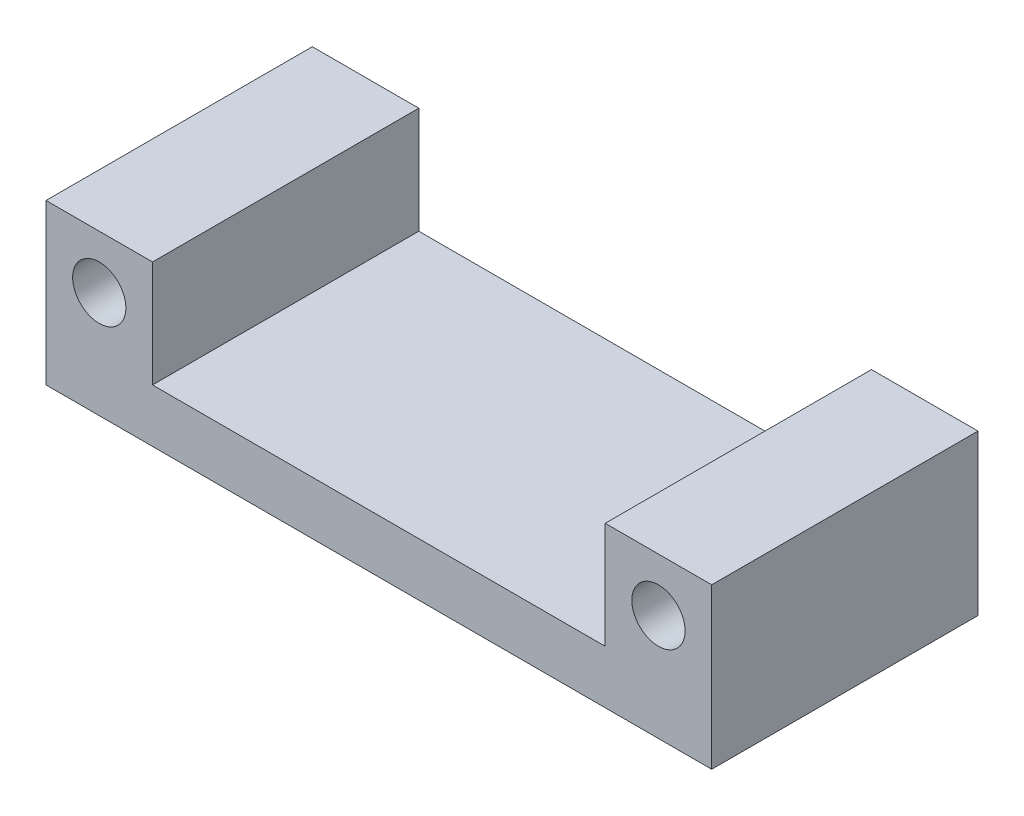
ISO-10303-21;
HEADER;
FILE_DESCRIPTION(('STEP AP214'),'2;1');
FILE_NAME('part.step','',(''),(''),'','','');
FILE_SCHEMA(('AUTOMOTIVE_DESIGN { 1 0 10303 214 1 1 1 1 }'));
ENDSEC;
DATA;
#1=APPLICATION_CONTEXT('core data for automotive mechanical design processes');
#2=APPLICATION_PROTOCOL_DEFINITION('international standard','automotive_design',2000,#1);
#3=PRODUCT_CONTEXT('',#1,'mechanical');
#4=PRODUCT('Part','Part','',(#3));
#5=PRODUCT_RELATED_PRODUCT_CATEGORY('part','',(#4));
#6=PRODUCT_DEFINITION_FORMATION('','',#4);
#7=PRODUCT_DEFINITION_CONTEXT('part definition',#1,'design');
#8=PRODUCT_DEFINITION('design','',#6,#7);
#9=PRODUCT_DEFINITION_SHAPE('','',#8);
#10=(LENGTH_UNIT() NAMED_UNIT(*) SI_UNIT(.MILLI.,.METRE.));
#11=(NAMED_UNIT(*) PLANE_ANGLE_UNIT() SI_UNIT($,.RADIAN.));
#12=(NAMED_UNIT(*) SI_UNIT($,.STERADIAN.) SOLID_ANGLE_UNIT());
#13=UNCERTAINTY_MEASURE_WITH_UNIT(LENGTH_MEASURE(1.E-05),#10,'distance_accuracy_value','');
#14=(GEOMETRIC_REPRESENTATION_CONTEXT(3) GLOBAL_UNCERTAINTY_ASSIGNED_CONTEXT((#13)) GLOBAL_UNIT_ASSIGNED_CONTEXT((#10,
#11,#12)) REPRESENTATION_CONTEXT('',''));
#15=CARTESIAN_POINT('',(0.,0.,0.));
#16=DIRECTION('',(0.,0.,1.));
#17=DIRECTION('',(1.,0.,0.));
#18=AXIS2_PLACEMENT_3D('',#15,#16,#17);
#19=CARTESIAN_POINT('',(-85.,20.,100.));
#20=DIRECTION('',(-1.,0.,0.));
#21=DIRECTION('',(0.,-1.,0.));
#22=AXIS2_PLACEMENT_3D('',#19,#20,#21);
#23=PLANE('',#22);
#24=DIRECTION('',(0.,1.,0.));
#25=VECTOR('',#24,1.);
#26=CARTESIAN_POINT('',(-85.,20.,0.));
#27=LINE('',#26,#25);
#28=CARTESIAN_POINT('',(-85.,20.,0.));
#29=VERTEX_POINT('',#28);
#30=CARTESIAN_POINT('',(-85.,60.,0.));
#31=VERTEX_POINT('',#30);
#32=EDGE_CURVE('E133',#29,#31,#27,.T.);
#33=ORIENTED_EDGE('',*,*,#32,.T.);
#34=DIRECTION('',(0.,0.,-1.));
#35=VECTOR('',#34,1.);
#36=CARTESIAN_POINT('',(-85.,60.,100.));
#37=LINE('',#36,#35);
#38=CARTESIAN_POINT('',(-85.,60.,100.));
#39=VERTEX_POINT('',#38);
#40=EDGE_CURVE('E11',#39,#31,#37,.T.);
#41=ORIENTED_EDGE('',*,*,#40,.F.);
#42=DIRECTION('',(0.,1.,0.));
#43=VECTOR('',#42,1.);
#44=CARTESIAN_POINT('',(-85.,20.,100.));
#45=LINE('',#44,#43);
#46=CARTESIAN_POINT('',(-85.,20.,100.));
#47=VERTEX_POINT('',#46);
#48=EDGE_CURVE('E148',#47,#39,#45,.T.);
#49=ORIENTED_EDGE('',*,*,#48,.F.);
#50=DIRECTION('',(0.,0.,-1.));
#51=VECTOR('',#50,1.);
#52=CARTESIAN_POINT('',(-85.,20.,100.));
#53=LINE('',#52,#51);
#54=EDGE_CURVE('E129',#47,#29,#53,.T.);
#55=ORIENTED_EDGE('',*,*,#54,.T.);
#56=EDGE_LOOP('',(#33,#41,#49,#55));
#57=FACE_BOUND('',#56,.T.);
#58=ADVANCED_FACE('F35',(#57),#23,.F.);
#59=CARTESIAN_POINT('',(-85.,60.,100.));
#60=DIRECTION('',(0.,-1.,0.));
#61=DIRECTION('',(1.,0.,0.));
#62=AXIS2_PLACEMENT_3D('',#59,#60,#61);
#63=PLANE('',#62);
#64=DIRECTION('',(-1.,0.,0.));
#65=VECTOR('',#64,1.);
#66=CARTESIAN_POINT('',(-85.,60.,0.));
#67=LINE('',#66,#65);
#68=CARTESIAN_POINT('',(-125.,60.,0.));
#69=VERTEX_POINT('',#68);
#70=EDGE_CURVE('E136',#31,#69,#67,.T.);
#71=ORIENTED_EDGE('',*,*,#70,.T.);
#72=DIRECTION('',(0.,0.,-1.));
#73=VECTOR('',#72,1.);
#74=CARTESIAN_POINT('',(-125.,60.,100.));
#75=LINE('',#74,#73);
#76=CARTESIAN_POINT('',(-125.,60.,100.));
#77=VERTEX_POINT('',#76);
#78=EDGE_CURVE('E44',#77,#69,#75,.T.);
#79=ORIENTED_EDGE('',*,*,#78,.F.);
#80=DIRECTION('',(-1.,0.,0.));
#81=VECTOR('',#80,1.);
#82=CARTESIAN_POINT('',(-85.,60.,100.));
#83=LINE('',#82,#81);
#84=EDGE_CURVE('E96',#39,#77,#83,.T.);
#85=ORIENTED_EDGE('',*,*,#84,.F.);
#86=ORIENTED_EDGE('',*,*,#40,.T.);
#87=EDGE_LOOP('',(#71,#79,#85,#86));
#88=FACE_BOUND('',#87,.T.);
#89=ADVANCED_FACE('F205',(#88),#63,.F.);
#90=CARTESIAN_POINT('',(-125.,60.,100.));
#91=DIRECTION('',(1.,0.,0.));
#92=DIRECTION('',(0.,1.,0.));
#93=AXIS2_PLACEMENT_3D('',#90,#91,#92);
#94=PLANE('',#93);
#95=DIRECTION('',(0.,-1.,0.));
#96=VECTOR('',#95,1.);
#97=CARTESIAN_POINT('',(-125.,60.,0.));
#98=LINE('',#97,#96);
#99=CARTESIAN_POINT('',(-125.,0.,0.));
#100=VERTEX_POINT('',#99);
#101=EDGE_CURVE('E139',#69,#100,#98,.T.);
#102=ORIENTED_EDGE('',*,*,#101,.T.);
#103=DIRECTION('',(0.,0.,-1.));
#104=VECTOR('',#103,1.);
#105=CARTESIAN_POINT('',(-125.,0.,100.));
#106=LINE('',#105,#104);
#107=CARTESIAN_POINT('',(-125.,0.,100.));
#108=VERTEX_POINT('',#107);
#109=EDGE_CURVE('E155',#108,#100,#106,.T.);
#110=ORIENTED_EDGE('',*,*,#109,.F.);
#111=DIRECTION('',(0.,-1.,0.));
#112=VECTOR('',#111,1.);
#113=CARTESIAN_POINT('',(-125.,60.,100.));
#114=LINE('',#113,#112);
#115=EDGE_CURVE('E173',#77,#108,#114,.T.);
#116=ORIENTED_EDGE('',*,*,#115,.F.);
#117=ORIENTED_EDGE('',*,*,#78,.T.);
#118=EDGE_LOOP('',(#102,#110,#116,#117));
#119=FACE_BOUND('',#118,.T.);
#120=ADVANCED_FACE('F209',(#119),#94,.F.);
#121=CARTESIAN_POINT('',(-125.,0.,100.));
#122=DIRECTION('',(0.,1.,0.));
#123=DIRECTION('',(-1.,0.,0.));
#124=AXIS2_PLACEMENT_3D('',#121,#122,#123);
#125=PLANE('',#124);
#126=DIRECTION('',(1.,0.,0.));
#127=VECTOR('',#126,1.);
#128=CARTESIAN_POINT('',(-125.,0.,0.));
#129=LINE('',#128,#127);
#130=CARTESIAN_POINT('',(125.,0.,0.));
#131=VERTEX_POINT('',#130);
#132=EDGE_CURVE('E141',#100,#131,#129,.T.);
#133=ORIENTED_EDGE('',*,*,#132,.T.);
#134=DIRECTION('',(0.,0.,-1.));
#135=VECTOR('',#134,1.);
#136=CARTESIAN_POINT('',(125.,0.,100.));
#137=LINE('',#136,#135);
#138=CARTESIAN_POINT('',(125.,0.,100.));
#139=VERTEX_POINT('',#138);
#140=EDGE_CURVE('E152',#139,#131,#137,.T.);
#141=ORIENTED_EDGE('',*,*,#140,.F.);
#142=DIRECTION('',(1.,0.,0.));
#143=VECTOR('',#142,1.);
#144=CARTESIAN_POINT('',(-125.,0.,100.));
#145=LINE('',#144,#143);
#146=EDGE_CURVE('E175',#108,#139,#145,.T.);
#147=ORIENTED_EDGE('',*,*,#146,.F.);
#148=ORIENTED_EDGE('',*,*,#109,.T.);
#149=EDGE_LOOP('',(#133,#141,#147,#148));
#150=FACE_BOUND('',#149,.T.);
#151=ADVANCED_FACE('F181',(#150),#125,.F.);
#152=CARTESIAN_POINT('',(125.,0.,100.));
#153=DIRECTION('',(-1.,0.,0.));
#154=DIRECTION('',(0.,-1.,0.));
#155=AXIS2_PLACEMENT_3D('',#152,#153,#154);
#156=PLANE('',#155);
#157=DIRECTION('',(0.,1.,0.));
#158=VECTOR('',#157,1.);
#159=CARTESIAN_POINT('',(125.,0.,0.));
#160=LINE('',#159,#158);
#161=CARTESIAN_POINT('',(125.,60.0000000000001,0.));
#162=VERTEX_POINT('',#161);
#163=EDGE_CURVE('E143',#131,#162,#160,.T.);
#164=ORIENTED_EDGE('',*,*,#163,.T.);
#165=DIRECTION('',(0.,0.,-1.));
#166=VECTOR('',#165,1.);
#167=CARTESIAN_POINT('',(125.,60.0000000000001,100.));
#168=LINE('',#167,#166);
#169=CARTESIAN_POINT('',(125.,60.0000000000001,100.));
#170=VERTEX_POINT('',#169);
#171=EDGE_CURVE('E124',#170,#162,#168,.T.);
#172=ORIENTED_EDGE('',*,*,#171,.F.);
#173=DIRECTION('',(0.,1.,0.));
#174=VECTOR('',#173,1.);
#175=CARTESIAN_POINT('',(125.,0.,100.));
#176=LINE('',#175,#174);
#177=EDGE_CURVE('E115',#139,#170,#176,.T.);
#178=ORIENTED_EDGE('',*,*,#177,.F.);
#179=ORIENTED_EDGE('',*,*,#140,.T.);
#180=EDGE_LOOP('',(#164,#172,#178,#179));
#181=FACE_BOUND('',#180,.T.);
#182=ADVANCED_FACE('F185',(#181),#156,.F.);
#183=CARTESIAN_POINT('',(125.,60.0000000000001,100.));
#184=DIRECTION('',(0.,-1.,0.));
#185=DIRECTION('',(1.,0.,0.));
#186=AXIS2_PLACEMENT_3D('',#183,#184,#185);
#187=PLANE('',#186);
#188=DIRECTION('',(-1.,0.,0.));
#189=VECTOR('',#188,1.);
#190=CARTESIAN_POINT('',(125.,60.0000000000001,0.));
#191=LINE('',#190,#189);
#192=CARTESIAN_POINT('',(85.,60.0000000000001,0.));
#193=VERTEX_POINT('',#192);
#194=EDGE_CURVE('E123',#162,#193,#191,.T.);
#195=ORIENTED_EDGE('',*,*,#194,.T.);
#196=DIRECTION('',(0.,0.,-1.));
#197=VECTOR('',#196,1.);
#198=CARTESIAN_POINT('',(85.,60.0000000000001,100.));
#199=LINE('',#198,#197);
#200=CARTESIAN_POINT('',(85.,60.0000000000001,100.));
#201=VERTEX_POINT('',#200);
#202=EDGE_CURVE('E120',#201,#193,#199,.T.);
#203=ORIENTED_EDGE('',*,*,#202,.F.);
#204=DIRECTION('',(-1.,0.,0.));
#205=VECTOR('',#204,1.);
#206=CARTESIAN_POINT('',(125.,60.0000000000001,100.));
#207=LINE('',#206,#205);
#208=EDGE_CURVE('E109',#170,#201,#207,.T.);
#209=ORIENTED_EDGE('',*,*,#208,.F.);
#210=ORIENTED_EDGE('',*,*,#171,.T.);
#211=EDGE_LOOP('',(#195,#203,#209,#210));
#212=FACE_BOUND('',#211,.T.);
#213=ADVANCED_FACE('F121',(#212),#187,.F.);
#214=CARTESIAN_POINT('',(85.,60.0000000000001,100.));
#215=DIRECTION('',(1.,0.,0.));
#216=DIRECTION('',(0.,0.,-1.));
#217=AXIS2_PLACEMENT_3D('',#214,#215,#216);
#218=PLANE('',#217);
#219=DIRECTION('',(0.,-1.,0.));
#220=VECTOR('',#219,1.);
#221=CARTESIAN_POINT('',(85.,60.0000000000001,0.));
#222=LINE('',#221,#220);
#223=CARTESIAN_POINT('',(85.,20.,0.));
#224=VERTEX_POINT('',#223);
#225=EDGE_CURVE('E82',#193,#224,#222,.T.);
#226=ORIENTED_EDGE('',*,*,#225,.T.);
#227=DIRECTION('',(0.,0.,-1.));
#228=VECTOR('',#227,1.);
#229=CARTESIAN_POINT('',(85.,20.,100.));
#230=LINE('',#229,#228);
#231=CARTESIAN_POINT('',(85.,20.,100.));
#232=VERTEX_POINT('',#231);
#233=EDGE_CURVE('E125',#232,#224,#230,.T.);
#234=ORIENTED_EDGE('',*,*,#233,.F.);
#235=DIRECTION('',(0.,-1.,0.));
#236=VECTOR('',#235,1.);
#237=CARTESIAN_POINT('',(85.,60.0000000000001,100.));
#238=LINE('',#237,#236);
#239=EDGE_CURVE('E113',#201,#232,#238,.T.);
#240=ORIENTED_EDGE('',*,*,#239,.F.);
#241=ORIENTED_EDGE('',*,*,#202,.T.);
#242=EDGE_LOOP('',(#226,#234,#240,#241));
#243=FACE_BOUND('',#242,.T.);
#244=ADVANCED_FACE('F127',(#243),#218,.F.);
#245=CARTESIAN_POINT('',(85.,20.,100.));
#246=DIRECTION('',(0.,-1.,0.));
#247=DIRECTION('',(1.,0.,0.));
#248=AXIS2_PLACEMENT_3D('',#245,#246,#247);
#249=PLANE('',#248);
#250=DIRECTION('',(-1.,0.,0.));
#251=VECTOR('',#250,1.);
#252=CARTESIAN_POINT('',(85.,20.,0.));
#253=LINE('',#252,#251);
#254=EDGE_CURVE('E88',#224,#29,#253,.T.);
#255=ORIENTED_EDGE('',*,*,#254,.T.);
#256=ORIENTED_EDGE('',*,*,#54,.F.);
#257=DIRECTION('',(-1.,0.,0.));
#258=VECTOR('',#257,1.);
#259=CARTESIAN_POINT('',(85.,20.,100.));
#260=LINE('',#259,#258);
#261=EDGE_CURVE('E53',#232,#47,#260,.T.);
#262=ORIENTED_EDGE('',*,*,#261,.F.);
#263=ORIENTED_EDGE('',*,*,#233,.T.);
#264=EDGE_LOOP('',(#255,#256,#262,#263));
#265=FACE_BOUND('',#264,.T.);
#266=ADVANCED_FACE('F193',(#265),#249,.F.);
#267=CARTESIAN_POINT('',(0.,0.,100.));
#268=DIRECTION('',(0.,0.,1.));
#269=DIRECTION('',(1.,0.,0.));
#270=AXIS2_PLACEMENT_3D('',#267,#268,#269);
#271=PLANE('',#270);
#272=CARTESIAN_POINT('',(105.,40.,100.));
#273=DIRECTION('',(0.,0.,1.));
#274=DIRECTION('',(1.,0.,0.));
#275=AXIS2_PLACEMENT_3D('',#272,#273,#274);
#276=CIRCLE('',#275,9.99999999999999);
#277=CARTESIAN_POINT('',(115.,40.,100.));
#278=VERTEX_POINT('',#277);
#279=EDGE_CURVE('E168',#278,#278,#276,.T.);
#280=ORIENTED_EDGE('',*,*,#279,.F.);
#281=EDGE_LOOP('',(#280));
#282=FACE_BOUND('',#281,.T.);
#283=CARTESIAN_POINT('',(-105.,40.,100.));
#284=DIRECTION('',(0.,0.,1.));
#285=DIRECTION('',(1.,0.,0.));
#286=AXIS2_PLACEMENT_3D('',#283,#284,#285);
#287=CIRCLE('',#286,9.99999999999999);
#288=CARTESIAN_POINT('',(-95.,40.,100.));
#289=VERTEX_POINT('',#288);
#290=EDGE_CURVE('E160',#289,#289,#287,.T.);
#291=ORIENTED_EDGE('',*,*,#290,.F.);
#292=EDGE_LOOP('',(#291));
#293=FACE_BOUND('',#292,.T.);
#294=ORIENTED_EDGE('',*,*,#48,.T.);
#295=ORIENTED_EDGE('',*,*,#84,.T.);
#296=ORIENTED_EDGE('',*,*,#115,.T.);
#297=ORIENTED_EDGE('',*,*,#146,.T.);
#298=ORIENTED_EDGE('',*,*,#177,.T.);
#299=ORIENTED_EDGE('',*,*,#208,.T.);
#300=ORIENTED_EDGE('',*,*,#239,.T.);
#301=ORIENTED_EDGE('',*,*,#261,.T.);
#302=EDGE_LOOP('',(#294,#295,#296,#297,#298,#299,#300,#301));
#303=FACE_BOUND('',#302,.T.);
#304=ADVANCED_FACE('F111',(#282,#293,#303),#271,.T.);
#305=CARTESIAN_POINT('',(0.,0.,0.));
#306=DIRECTION('',(0.,0.,1.));
#307=DIRECTION('',(1.,0.,0.));
#308=AXIS2_PLACEMENT_3D('',#305,#306,#307);
#309=PLANE('',#308);
#310=CARTESIAN_POINT('',(105.,40.,0.));
#311=DIRECTION('',(0.,0.,1.));
#312=DIRECTION('',(1.,0.,0.));
#313=AXIS2_PLACEMENT_3D('',#310,#311,#312);
#314=CIRCLE('',#313,9.99999999999999);
#315=CARTESIAN_POINT('',(115.,40.,0.));
#316=VERTEX_POINT('',#315);
#317=EDGE_CURVE('E38',#316,#316,#314,.T.);
#318=ORIENTED_EDGE('',*,*,#317,.T.);
#319=EDGE_LOOP('',(#318));
#320=FACE_BOUND('',#319,.T.);
#321=CARTESIAN_POINT('',(-105.,40.,0.));
#322=DIRECTION('',(0.,0.,1.));
#323=DIRECTION('',(1.,0.,0.));
#324=AXIS2_PLACEMENT_3D('',#321,#322,#323);
#325=CIRCLE('',#324,9.99999999999999);
#326=CARTESIAN_POINT('',(-95.,40.,0.));
#327=VERTEX_POINT('',#326);
#328=EDGE_CURVE('E137',#327,#327,#325,.T.);
#329=ORIENTED_EDGE('',*,*,#328,.T.);
#330=EDGE_LOOP('',(#329));
#331=FACE_BOUND('',#330,.T.);
#332=ORIENTED_EDGE('',*,*,#32,.F.);
#333=ORIENTED_EDGE('',*,*,#254,.F.);
#334=ORIENTED_EDGE('',*,*,#225,.F.);
#335=ORIENTED_EDGE('',*,*,#194,.F.);
#336=ORIENTED_EDGE('',*,*,#163,.F.);
#337=ORIENTED_EDGE('',*,*,#132,.F.);
#338=ORIENTED_EDGE('',*,*,#101,.F.);
#339=ORIENTED_EDGE('',*,*,#70,.F.);
#340=EDGE_LOOP('',(#332,#333,#334,#335,#336,#337,#338,#339));
#341=FACE_BOUND('',#340,.T.);
#342=ADVANCED_FACE('F188',(#320,#331,#341),#309,.F.);
#343=CARTESIAN_POINT('',(-105.,40.,-30.0000000000001));
#344=DIRECTION('',(0.,0.,1.));
#345=DIRECTION('',(1.,0.,0.));
#346=AXIS2_PLACEMENT_3D('',#343,#344,#345);
#347=CYLINDRICAL_SURFACE('',#346,9.99999999999999);
#348=ORIENTED_EDGE('',*,*,#290,.T.);
#349=EDGE_LOOP('',(#348));
#350=FACE_BOUND('',#349,.T.);
#351=ORIENTED_EDGE('',*,*,#328,.F.);
#352=EDGE_LOOP('',(#351));
#353=FACE_BOUND('',#352,.T.);
#354=ADVANCED_FACE('F248',(#350,#353),#347,.F.);
#355=CARTESIAN_POINT('',(105.,40.,-30.0000000000001));
#356=DIRECTION('',(0.,0.,1.));
#357=DIRECTION('',(1.,0.,0.));
#358=AXIS2_PLACEMENT_3D('',#355,#356,#357);
#359=CYLINDRICAL_SURFACE('',#358,9.99999999999999);
#360=ORIENTED_EDGE('',*,*,#279,.T.);
#361=EDGE_LOOP('',(#360));
#362=FACE_BOUND('',#361,.T.);
#363=ORIENTED_EDGE('',*,*,#317,.F.);
#364=EDGE_LOOP('',(#363));
#365=FACE_BOUND('',#364,.T.);
#366=ADVANCED_FACE('F257',(#362,#365),#359,.F.);
#367=CLOSED_SHELL('',(#58,#89,#120,#151,#182,#213,#244,#266,#304,#342,#354,#366));
#368=MANIFOLD_SOLID_BREP('B2',#367);
#369=ADVANCED_BREP_SHAPE_REPRESENTATION('',(#18,#368),#14);
#370=SHAPE_DEFINITION_REPRESENTATION(#9,#369);
ENDSEC;
END-ISO-10303-21;
